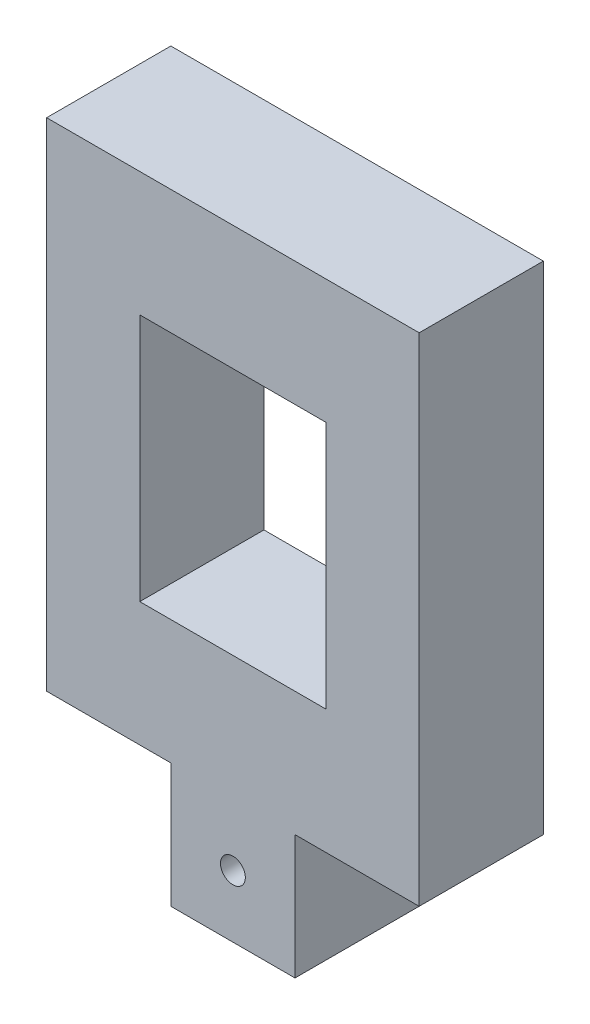
ISO-10303-21;
HEADER;
FILE_DESCRIPTION(('STEP AP214'),'2;1');
FILE_NAME('part.step','',(''),(''),'','','');
FILE_SCHEMA(('AUTOMOTIVE_DESIGN { 1 0 10303 214 1 1 1 1 }'));
ENDSEC;
DATA;
#1=APPLICATION_CONTEXT('core data for automotive mechanical design processes');
#2=APPLICATION_PROTOCOL_DEFINITION('international standard','automotive_design',2000,#1);
#3=PRODUCT_CONTEXT('',#1,'mechanical');
#4=PRODUCT('Part','Part','',(#3));
#5=PRODUCT_RELATED_PRODUCT_CATEGORY('part','',(#4));
#6=PRODUCT_DEFINITION_FORMATION('','',#4);
#7=PRODUCT_DEFINITION_CONTEXT('part definition',#1,'design');
#8=PRODUCT_DEFINITION('design','',#6,#7);
#9=PRODUCT_DEFINITION_SHAPE('','',#8);
#10=(LENGTH_UNIT() NAMED_UNIT(*) SI_UNIT(.MILLI.,.METRE.));
#11=(NAMED_UNIT(*) PLANE_ANGLE_UNIT() SI_UNIT($,.RADIAN.));
#12=(NAMED_UNIT(*) SI_UNIT($,.STERADIAN.) SOLID_ANGLE_UNIT());
#13=UNCERTAINTY_MEASURE_WITH_UNIT(LENGTH_MEASURE(1.E-05),#10,'distance_accuracy_value','');
#14=(GEOMETRIC_REPRESENTATION_CONTEXT(3) GLOBAL_UNCERTAINTY_ASSIGNED_CONTEXT((#13)) GLOBAL_UNIT_ASSIGNED_CONTEXT((#10,
#11,#12)) REPRESENTATION_CONTEXT('',''));
#15=CARTESIAN_POINT('',(0.,0.,0.));
#16=DIRECTION('',(0.,0.,1.));
#17=DIRECTION('',(1.,0.,0.));
#18=AXIS2_PLACEMENT_3D('',#15,#16,#17);
#19=CARTESIAN_POINT('',(0.,0.,6.35));
#20=DIRECTION('',(1.,0.,0.));
#21=DIRECTION('',(0.,1.,0.));
#22=AXIS2_PLACEMENT_3D('',#19,#20,#21);
#23=PLANE('',#22);
#24=DIRECTION('',(0.,-1.,0.));
#25=VECTOR('',#24,1.);
#26=CARTESIAN_POINT('',(0.,0.,0.));
#27=LINE('',#26,#25);
#28=CARTESIAN_POINT('',(0.,31.75,0.));
#29=VERTEX_POINT('',#28);
#30=CARTESIAN_POINT('',(0.,6.35,0.));
#31=VERTEX_POINT('',#30);
#32=EDGE_CURVE('E140',#29,#31,#27,.T.);
#33=ORIENTED_EDGE('',*,*,#32,.T.);
#34=DIRECTION('',(0.,0.,-1.));
#35=VECTOR('',#34,1.);
#36=CARTESIAN_POINT('',(0.,6.35,6.35));
#37=LINE('',#36,#35);
#38=CARTESIAN_POINT('',(0.,6.35,6.35));
#39=VERTEX_POINT('',#38);
#40=EDGE_CURVE('E49',#39,#31,#37,.T.);
#41=ORIENTED_EDGE('',*,*,#40,.F.);
#42=DIRECTION('',(0.,-1.,0.));
#43=VECTOR('',#42,1.);
#44=CARTESIAN_POINT('',(0.,0.,6.35));
#45=LINE('',#44,#43);
#46=CARTESIAN_POINT('',(0.,31.75,6.35));
#47=VERTEX_POINT('',#46);
#48=EDGE_CURVE('E138',#47,#39,#45,.T.);
#49=ORIENTED_EDGE('',*,*,#48,.F.);
#50=DIRECTION('',(0.,0.,-1.));
#51=VECTOR('',#50,1.);
#52=CARTESIAN_POINT('',(0.,31.75,6.35));
#53=LINE('',#52,#51);
#54=EDGE_CURVE('E42',#47,#29,#53,.T.);
#55=ORIENTED_EDGE('',*,*,#54,.T.);
#56=EDGE_LOOP('',(#33,#41,#49,#55));
#57=FACE_BOUND('',#56,.T.);
#58=ADVANCED_FACE('F35',(#57),#23,.F.);
#59=CARTESIAN_POINT('',(0.,0.,6.35));
#60=DIRECTION('',(0.,1.,0.));
#61=DIRECTION('',(0.,0.,1.));
#62=AXIS2_PLACEMENT_3D('',#59,#60,#61);
#63=PLANE('',#62);
#64=DIRECTION('',(1.,0.,0.));
#65=VECTOR('',#64,1.);
#66=CARTESIAN_POINT('',(0.,0.,6.35));
#67=LINE('',#66,#65);
#68=CARTESIAN_POINT('',(6.35,0.,6.35));
#69=VERTEX_POINT('',#68);
#70=CARTESIAN_POINT('',(12.7,0.,6.35));
#71=VERTEX_POINT('',#70);
#72=EDGE_CURVE('E146',#69,#71,#67,.T.);
#73=ORIENTED_EDGE('',*,*,#72,.F.);
#74=DIRECTION('',(0.,0.,-1.));
#75=VECTOR('',#74,1.);
#76=CARTESIAN_POINT('',(6.35,0.,6.35));
#77=LINE('',#76,#75);
#78=CARTESIAN_POINT('',(6.35,0.,0.));
#79=VERTEX_POINT('',#78);
#80=EDGE_CURVE('E178',#69,#79,#77,.T.);
#81=ORIENTED_EDGE('',*,*,#80,.T.);
#82=DIRECTION('',(1.,0.,0.));
#83=VECTOR('',#82,1.);
#84=CARTESIAN_POINT('',(0.,0.,0.));
#85=LINE('',#84,#83);
#86=CARTESIAN_POINT('',(12.7,0.,0.));
#87=VERTEX_POINT('',#86);
#88=EDGE_CURVE('E57',#79,#87,#85,.T.);
#89=ORIENTED_EDGE('',*,*,#88,.T.);
#90=DIRECTION('',(0.,0.,-1.));
#91=VECTOR('',#90,1.);
#92=CARTESIAN_POINT('',(12.7,0.,6.35));
#93=LINE('',#92,#91);
#94=EDGE_CURVE('E189',#71,#87,#93,.T.);
#95=ORIENTED_EDGE('',*,*,#94,.F.);
#96=EDGE_LOOP('',(#73,#81,#89,#95));
#97=FACE_BOUND('',#96,.T.);
#98=ADVANCED_FACE('F256',(#97),#63,.F.);
#99=CARTESIAN_POINT('',(19.05,0.,6.35));
#100=DIRECTION('',(-1.,0.,0.));
#101=DIRECTION('',(0.,-1.,0.));
#102=AXIS2_PLACEMENT_3D('',#99,#100,#101);
#103=PLANE('',#102);
#104=DIRECTION('',(0.,1.,0.));
#105=VECTOR('',#104,1.);
#106=CARTESIAN_POINT('',(19.05,0.,6.35));
#107=LINE('',#106,#105);
#108=CARTESIAN_POINT('',(19.05,6.35,6.35));
#109=VERTEX_POINT('',#108);
#110=CARTESIAN_POINT('',(19.05,31.75,6.35));
#111=VERTEX_POINT('',#110);
#112=EDGE_CURVE('E149',#109,#111,#107,.T.);
#113=ORIENTED_EDGE('',*,*,#112,.F.);
#114=DIRECTION('',(0.,0.,-1.));
#115=VECTOR('',#114,1.);
#116=CARTESIAN_POINT('',(19.05,6.35,6.35));
#117=LINE('',#116,#115);
#118=CARTESIAN_POINT('',(19.05,6.35,0.));
#119=VERTEX_POINT('',#118);
#120=EDGE_CURVE('E193',#109,#119,#117,.T.);
#121=ORIENTED_EDGE('',*,*,#120,.T.);
#122=DIRECTION('',(0.,1.,0.));
#123=VECTOR('',#122,1.);
#124=CARTESIAN_POINT('',(19.05,0.,0.));
#125=LINE('',#124,#123);
#126=CARTESIAN_POINT('',(19.05,31.75,0.));
#127=VERTEX_POINT('',#126);
#128=EDGE_CURVE('E151',#119,#127,#125,.T.);
#129=ORIENTED_EDGE('',*,*,#128,.T.);
#130=DIRECTION('',(0.,0.,-1.));
#131=VECTOR('',#130,1.);
#132=CARTESIAN_POINT('',(19.05,31.75,6.35));
#133=LINE('',#132,#131);
#134=EDGE_CURVE('E11',#111,#127,#133,.T.);
#135=ORIENTED_EDGE('',*,*,#134,.F.);
#136=EDGE_LOOP('',(#113,#121,#129,#135));
#137=FACE_BOUND('',#136,.T.);
#138=ADVANCED_FACE('F261',(#137),#103,.F.);
#139=CARTESIAN_POINT('',(0.,31.75,6.35));
#140=DIRECTION('',(0.,-1.,0.));
#141=DIRECTION('',(0.,0.,-1.));
#142=AXIS2_PLACEMENT_3D('',#139,#140,#141);
#143=PLANE('',#142);
#144=DIRECTION('',(-1.,0.,0.));
#145=VECTOR('',#144,1.);
#146=CARTESIAN_POINT('',(0.,31.75,0.));
#147=LINE('',#146,#145);
#148=EDGE_CURVE('E147',#127,#29,#147,.T.);
#149=ORIENTED_EDGE('',*,*,#148,.T.);
#150=ORIENTED_EDGE('',*,*,#54,.F.);
#151=DIRECTION('',(-1.,0.,0.));
#152=VECTOR('',#151,1.);
#153=CARTESIAN_POINT('',(0.,31.75,6.35));
#154=LINE('',#153,#152);
#155=EDGE_CURVE('E144',#111,#47,#154,.T.);
#156=ORIENTED_EDGE('',*,*,#155,.F.);
#157=ORIENTED_EDGE('',*,*,#134,.T.);
#158=EDGE_LOOP('',(#149,#150,#156,#157));
#159=FACE_BOUND('',#158,.T.);
#160=ADVANCED_FACE('F265',(#159),#143,.F.);
#161=CARTESIAN_POINT('',(0.,0.,6.35));
#162=DIRECTION('',(0.,0.,-1.));
#163=DIRECTION('',(-1.,0.,0.));
#164=AXIS2_PLACEMENT_3D('',#161,#162,#163);
#165=PLANE('',#164);
#166=CARTESIAN_POINT('',(9.525,3.175,6.35));
#167=DIRECTION('',(0.,0.,1.));
#168=DIRECTION('',(1.,0.,0.));
#169=AXIS2_PLACEMENT_3D('',#166,#167,#168);
#170=CIRCLE('',#169,0.635000000000001);
#171=CARTESIAN_POINT('',(10.16,3.175,6.35));
#172=VERTEX_POINT('',#171);
#173=EDGE_CURVE('E174',#172,#172,#170,.T.);
#174=ORIENTED_EDGE('',*,*,#173,.F.);
#175=EDGE_LOOP('',(#174));
#176=FACE_BOUND('',#175,.T.);
#177=DIRECTION('',(1.,0.,0.));
#178=VECTOR('',#177,1.);
#179=CARTESIAN_POINT('',(4.7625,12.7,6.35));
#180=LINE('',#179,#178);
#181=CARTESIAN_POINT('',(4.7625,12.7,6.35));
#182=VERTEX_POINT('',#181);
#183=CARTESIAN_POINT('',(14.2875,12.7,6.35));
#184=VERTEX_POINT('',#183);
#185=EDGE_CURVE('E214',#182,#184,#180,.T.);
#186=ORIENTED_EDGE('',*,*,#185,.F.);
#187=DIRECTION('',(0.,-1.,0.));
#188=VECTOR('',#187,1.);
#189=CARTESIAN_POINT('',(4.7625,25.4,6.35));
#190=LINE('',#189,#188);
#191=CARTESIAN_POINT('',(4.7625,25.4,6.35));
#192=VERTEX_POINT('',#191);
#193=EDGE_CURVE('E196',#192,#182,#190,.T.);
#194=ORIENTED_EDGE('',*,*,#193,.F.);
#195=DIRECTION('',(-1.,0.,0.));
#196=VECTOR('',#195,1.);
#197=CARTESIAN_POINT('',(4.7625,25.4,6.35));
#198=LINE('',#197,#196);
#199=CARTESIAN_POINT('',(14.2875,25.4,6.35));
#200=VERTEX_POINT('',#199);
#201=EDGE_CURVE('E204',#200,#192,#198,.T.);
#202=ORIENTED_EDGE('',*,*,#201,.F.);
#203=DIRECTION('',(0.,1.,0.));
#204=VECTOR('',#203,1.);
#205=CARTESIAN_POINT('',(14.2875,25.4,6.35));
#206=LINE('',#205,#204);
#207=EDGE_CURVE('E217',#184,#200,#206,.T.);
#208=ORIENTED_EDGE('',*,*,#207,.F.);
#209=EDGE_LOOP('',(#186,#194,#202,#208));
#210=FACE_BOUND('',#209,.T.);
#211=DIRECTION('',(1.,0.,0.));
#212=VECTOR('',#211,1.);
#213=CARTESIAN_POINT('',(0.,6.35,6.35));
#214=LINE('',#213,#212);
#215=CARTESIAN_POINT('',(6.35,6.35,6.35));
#216=VERTEX_POINT('',#215);
#217=EDGE_CURVE('E124',#39,#216,#214,.T.);
#218=ORIENTED_EDGE('',*,*,#217,.T.);
#219=DIRECTION('',(0.,-1.,0.));
#220=VECTOR('',#219,1.);
#221=CARTESIAN_POINT('',(6.35,0.,6.35));
#222=LINE('',#221,#220);
#223=EDGE_CURVE('E131',#216,#69,#222,.T.);
#224=ORIENTED_EDGE('',*,*,#223,.T.);
#225=ORIENTED_EDGE('',*,*,#72,.T.);
#226=DIRECTION('',(0.,1.,0.));
#227=VECTOR('',#226,1.);
#228=CARTESIAN_POINT('',(12.7,0.,6.35));
#229=LINE('',#228,#227);
#230=CARTESIAN_POINT('',(12.7,6.35,6.35));
#231=VERTEX_POINT('',#230);
#232=EDGE_CURVE('E182',#71,#231,#229,.T.);
#233=ORIENTED_EDGE('',*,*,#232,.T.);
#234=DIRECTION('',(1.,0.,0.));
#235=VECTOR('',#234,1.);
#236=CARTESIAN_POINT('',(19.05,6.35,6.35));
#237=LINE('',#236,#235);
#238=EDGE_CURVE('E185',#231,#109,#237,.T.);
#239=ORIENTED_EDGE('',*,*,#238,.T.);
#240=ORIENTED_EDGE('',*,*,#112,.T.);
#241=ORIENTED_EDGE('',*,*,#155,.T.);
#242=ORIENTED_EDGE('',*,*,#48,.T.);
#243=EDGE_LOOP('',(#218,#224,#225,#233,#239,#240,#241,#242));
#244=FACE_BOUND('',#243,.T.);
#245=ADVANCED_FACE('F142',(#176,#210,#244),#165,.F.);
#246=CARTESIAN_POINT('',(0.,0.,0.));
#247=DIRECTION('',(0.,0.,-1.));
#248=DIRECTION('',(-1.,0.,0.));
#249=AXIS2_PLACEMENT_3D('',#246,#247,#248);
#250=PLANE('',#249);
#251=CARTESIAN_POINT('',(9.525,3.175,0.));
#252=DIRECTION('',(0.,0.,1.));
#253=DIRECTION('',(1.,0.,0.));
#254=AXIS2_PLACEMENT_3D('',#251,#252,#253);
#255=CIRCLE('',#254,0.635000000000001);
#256=CARTESIAN_POINT('',(10.16,3.175,0.));
#257=VERTEX_POINT('',#256);
#258=EDGE_CURVE('E170',#257,#257,#255,.T.);
#259=ORIENTED_EDGE('',*,*,#258,.T.);
#260=EDGE_LOOP('',(#259));
#261=FACE_BOUND('',#260,.T.);
#262=DIRECTION('',(0.,-1.,0.));
#263=VECTOR('',#262,1.);
#264=CARTESIAN_POINT('',(6.35,0.,0.));
#265=LINE('',#264,#263);
#266=CARTESIAN_POINT('',(6.35,6.35,0.));
#267=VERTEX_POINT('',#266);
#268=EDGE_CURVE('E132',#267,#79,#265,.T.);
#269=ORIENTED_EDGE('',*,*,#268,.F.);
#270=DIRECTION('',(1.,0.,0.));
#271=VECTOR('',#270,1.);
#272=CARTESIAN_POINT('',(0.,6.35,0.));
#273=LINE('',#272,#271);
#274=EDGE_CURVE('E169',#31,#267,#273,.T.);
#275=ORIENTED_EDGE('',*,*,#274,.F.);
#276=ORIENTED_EDGE('',*,*,#32,.F.);
#277=ORIENTED_EDGE('',*,*,#148,.F.);
#278=ORIENTED_EDGE('',*,*,#128,.F.);
#279=DIRECTION('',(1.,0.,0.));
#280=VECTOR('',#279,1.);
#281=CARTESIAN_POINT('',(19.05,6.35,0.));
#282=LINE('',#281,#280);
#283=CARTESIAN_POINT('',(12.7,6.35,0.));
#284=VERTEX_POINT('',#283);
#285=EDGE_CURVE('E186',#284,#119,#282,.T.);
#286=ORIENTED_EDGE('',*,*,#285,.F.);
#287=DIRECTION('',(0.,1.,0.));
#288=VECTOR('',#287,1.);
#289=CARTESIAN_POINT('',(12.7,0.,0.));
#290=LINE('',#289,#288);
#291=EDGE_CURVE('E180',#87,#284,#290,.T.);
#292=ORIENTED_EDGE('',*,*,#291,.F.);
#293=ORIENTED_EDGE('',*,*,#88,.F.);
#294=EDGE_LOOP('',(#269,#275,#276,#277,#278,#286,#292,#293));
#295=FACE_BOUND('',#294,.T.);
#296=DIRECTION('',(0.,-1.,0.));
#297=VECTOR('',#296,1.);
#298=CARTESIAN_POINT('',(4.7625,25.4,0.));
#299=LINE('',#298,#297);
#300=CARTESIAN_POINT('',(4.7625,25.4,0.));
#301=VERTEX_POINT('',#300);
#302=CARTESIAN_POINT('',(4.7625,12.7,0.));
#303=VERTEX_POINT('',#302);
#304=EDGE_CURVE('E200',#301,#303,#299,.T.);
#305=ORIENTED_EDGE('',*,*,#304,.T.);
#306=DIRECTION('',(1.,0.,0.));
#307=VECTOR('',#306,1.);
#308=CARTESIAN_POINT('',(4.7625,12.7,0.));
#309=LINE('',#308,#307);
#310=CARTESIAN_POINT('',(14.2875,12.7,0.));
#311=VERTEX_POINT('',#310);
#312=EDGE_CURVE('E203',#303,#311,#309,.T.);
#313=ORIENTED_EDGE('',*,*,#312,.T.);
#314=DIRECTION('',(0.,1.,0.));
#315=VECTOR('',#314,1.);
#316=CARTESIAN_POINT('',(14.2875,25.4,0.));
#317=LINE('',#316,#315);
#318=CARTESIAN_POINT('',(14.2875,25.4,0.));
#319=VERTEX_POINT('',#318);
#320=EDGE_CURVE('E207',#311,#319,#317,.T.);
#321=ORIENTED_EDGE('',*,*,#320,.T.);
#322=DIRECTION('',(-1.,0.,0.));
#323=VECTOR('',#322,1.);
#324=CARTESIAN_POINT('',(4.7625,25.4,0.));
#325=LINE('',#324,#323);
#326=EDGE_CURVE('E210',#319,#301,#325,.T.);
#327=ORIENTED_EDGE('',*,*,#326,.T.);
#328=EDGE_LOOP('',(#305,#313,#321,#327));
#329=FACE_BOUND('',#328,.T.);
#330=ADVANCED_FACE('F166',(#261,#295,#329),#250,.T.);
#331=CARTESIAN_POINT('',(4.7625,25.4,0.));
#332=DIRECTION('',(-1.,0.,0.));
#333=DIRECTION('',(0.,-1.,0.));
#334=AXIS2_PLACEMENT_3D('',#331,#332,#333);
#335=PLANE('',#334);
#336=ORIENTED_EDGE('',*,*,#193,.T.);
#337=DIRECTION('',(0.,0.,1.));
#338=VECTOR('',#337,1.);
#339=CARTESIAN_POINT('',(4.7625,12.7,0.));
#340=LINE('',#339,#338);
#341=EDGE_CURVE('E154',#303,#182,#340,.T.);
#342=ORIENTED_EDGE('',*,*,#341,.F.);
#343=ORIENTED_EDGE('',*,*,#304,.F.);
#344=DIRECTION('',(0.,0.,1.));
#345=VECTOR('',#344,1.);
#346=CARTESIAN_POINT('',(4.7625,25.4,0.));
#347=LINE('',#346,#345);
#348=EDGE_CURVE('E160',#301,#192,#347,.T.);
#349=ORIENTED_EDGE('',*,*,#348,.T.);
#350=EDGE_LOOP('',(#336,#342,#343,#349));
#351=FACE_BOUND('',#350,.T.);
#352=ADVANCED_FACE('F242',(#351),#335,.F.);
#353=CARTESIAN_POINT('',(4.7625,25.4,0.));
#354=DIRECTION('',(0.,1.,0.));
#355=DIRECTION('',(-1.,0.,0.));
#356=AXIS2_PLACEMENT_3D('',#353,#354,#355);
#357=PLANE('',#356);
#358=ORIENTED_EDGE('',*,*,#201,.T.);
#359=ORIENTED_EDGE('',*,*,#348,.F.);
#360=ORIENTED_EDGE('',*,*,#326,.F.);
#361=DIRECTION('',(0.,0.,1.));
#362=VECTOR('',#361,1.);
#363=CARTESIAN_POINT('',(14.2875,25.4,0.));
#364=LINE('',#363,#362);
#365=EDGE_CURVE('E223',#319,#200,#364,.T.);
#366=ORIENTED_EDGE('',*,*,#365,.T.);
#367=EDGE_LOOP('',(#358,#359,#360,#366));
#368=FACE_BOUND('',#367,.T.);
#369=ADVANCED_FACE('F241',(#368),#357,.F.);
#370=CARTESIAN_POINT('',(14.2875,25.4,0.));
#371=DIRECTION('',(1.,0.,0.));
#372=DIRECTION('',(0.,0.,-1.));
#373=AXIS2_PLACEMENT_3D('',#370,#371,#372);
#374=PLANE('',#373);
#375=ORIENTED_EDGE('',*,*,#207,.T.);
#376=ORIENTED_EDGE('',*,*,#365,.F.);
#377=ORIENTED_EDGE('',*,*,#320,.F.);
#378=DIRECTION('',(0.,0.,1.));
#379=VECTOR('',#378,1.);
#380=CARTESIAN_POINT('',(14.2875,12.7,0.));
#381=LINE('',#380,#379);
#382=EDGE_CURVE('E224',#311,#184,#381,.T.);
#383=ORIENTED_EDGE('',*,*,#382,.T.);
#384=EDGE_LOOP('',(#375,#376,#377,#383));
#385=FACE_BOUND('',#384,.T.);
#386=ADVANCED_FACE('F238',(#385),#374,.F.);
#387=CARTESIAN_POINT('',(4.7625,12.7,0.));
#388=DIRECTION('',(0.,-1.,0.));
#389=DIRECTION('',(0.,0.,-1.));
#390=AXIS2_PLACEMENT_3D('',#387,#388,#389);
#391=PLANE('',#390);
#392=ORIENTED_EDGE('',*,*,#185,.T.);
#393=ORIENTED_EDGE('',*,*,#382,.F.);
#394=ORIENTED_EDGE('',*,*,#312,.F.);
#395=ORIENTED_EDGE('',*,*,#341,.T.);
#396=EDGE_LOOP('',(#392,#393,#394,#395));
#397=FACE_BOUND('',#396,.T.);
#398=ADVANCED_FACE('F231',(#397),#391,.F.);
#399=CARTESIAN_POINT('',(19.05,6.35,6.35));
#400=DIRECTION('',(0.,1.,0.));
#401=DIRECTION('',(0.,0.,1.));
#402=AXIS2_PLACEMENT_3D('',#399,#400,#401);
#403=PLANE('',#402);
#404=ORIENTED_EDGE('',*,*,#285,.T.);
#405=ORIENTED_EDGE('',*,*,#120,.F.);
#406=ORIENTED_EDGE('',*,*,#238,.F.);
#407=DIRECTION('',(0.,0.,-1.));
#408=VECTOR('',#407,1.);
#409=CARTESIAN_POINT('',(12.7,6.35,6.35));
#410=LINE('',#409,#408);
#411=EDGE_CURVE('E197',#231,#284,#410,.T.);
#412=ORIENTED_EDGE('',*,*,#411,.T.);
#413=EDGE_LOOP('',(#404,#405,#406,#412));
#414=FACE_BOUND('',#413,.T.);
#415=ADVANCED_FACE('F295',(#414),#403,.F.);
#416=CARTESIAN_POINT('',(12.7,0.,6.35));
#417=DIRECTION('',(-1.,0.,0.));
#418=DIRECTION('',(0.,0.,1.));
#419=AXIS2_PLACEMENT_3D('',#416,#417,#418);
#420=PLANE('',#419);
#421=ORIENTED_EDGE('',*,*,#291,.T.);
#422=ORIENTED_EDGE('',*,*,#411,.F.);
#423=ORIENTED_EDGE('',*,*,#232,.F.);
#424=ORIENTED_EDGE('',*,*,#94,.T.);
#425=EDGE_LOOP('',(#421,#422,#423,#424));
#426=FACE_BOUND('',#425,.T.);
#427=ADVANCED_FACE('F292',(#426),#420,.F.);
#428=CARTESIAN_POINT('',(6.35,0.,6.35));
#429=DIRECTION('',(1.,0.,0.));
#430=DIRECTION('',(0.,1.,0.));
#431=AXIS2_PLACEMENT_3D('',#428,#429,#430);
#432=PLANE('',#431);
#433=ORIENTED_EDGE('',*,*,#268,.T.);
#434=ORIENTED_EDGE('',*,*,#80,.F.);
#435=ORIENTED_EDGE('',*,*,#223,.F.);
#436=DIRECTION('',(0.,0.,-1.));
#437=VECTOR('',#436,1.);
#438=CARTESIAN_POINT('',(6.35,6.35,6.35));
#439=LINE('',#438,#437);
#440=EDGE_CURVE('E126',#216,#267,#439,.T.);
#441=ORIENTED_EDGE('',*,*,#440,.T.);
#442=EDGE_LOOP('',(#433,#434,#435,#441));
#443=FACE_BOUND('',#442,.T.);
#444=ADVANCED_FACE('F287',(#443),#432,.F.);
#445=CARTESIAN_POINT('',(0.,6.35,6.35));
#446=DIRECTION('',(0.,1.,0.));
#447=DIRECTION('',(-1.,0.,0.));
#448=AXIS2_PLACEMENT_3D('',#445,#446,#447);
#449=PLANE('',#448);
#450=ORIENTED_EDGE('',*,*,#274,.T.);
#451=ORIENTED_EDGE('',*,*,#440,.F.);
#452=ORIENTED_EDGE('',*,*,#217,.F.);
#453=ORIENTED_EDGE('',*,*,#40,.T.);
#454=EDGE_LOOP('',(#450,#451,#452,#453));
#455=FACE_BOUND('',#454,.T.);
#456=ADVANCED_FACE('F125',(#455),#449,.F.);
#457=CARTESIAN_POINT('',(9.525,3.175,0.));
#458=DIRECTION('',(0.,0.,1.));
#459=DIRECTION('',(1.,0.,0.));
#460=AXIS2_PLACEMENT_3D('',#457,#458,#459);
#461=CYLINDRICAL_SURFACE('',#460,0.635000000000001);
#462=ORIENTED_EDGE('',*,*,#258,.F.);
#463=EDGE_LOOP('',(#462));
#464=FACE_BOUND('',#463,.T.);
#465=ORIENTED_EDGE('',*,*,#173,.T.);
#466=EDGE_LOOP('',(#465));
#467=FACE_BOUND('',#466,.T.);
#468=ADVANCED_FACE('F280',(#464,#467),#461,.F.);
#469=CLOSED_SHELL('',(#58,#98,#138,#160,#245,#330,#352,#369,#386,#398,#415,#427,#444,#456,#468));
#470=MANIFOLD_SOLID_BREP('B2',#469);
#471=ADVANCED_BREP_SHAPE_REPRESENTATION('',(#18,#470),#14);
#472=SHAPE_DEFINITION_REPRESENTATION(#9,#471);
ENDSEC;
END-ISO-10303-21;
